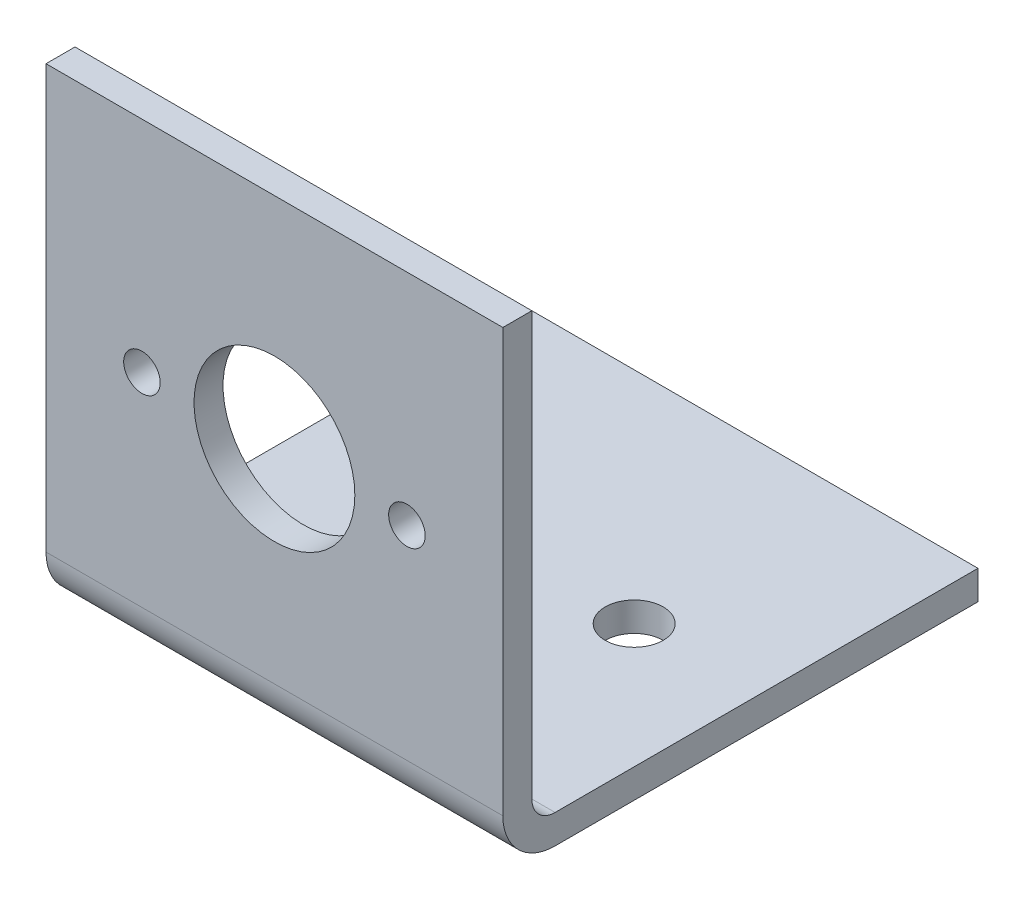
ISO-10303-21;
HEADER;
FILE_DESCRIPTION(('STEP AP214'),'2;1');
FILE_NAME('part.step','',(''),(''),'','','');
FILE_SCHEMA(('AUTOMOTIVE_DESIGN { 1 0 10303 214 1 1 1 1 }'));
ENDSEC;
DATA;
#1=APPLICATION_CONTEXT('core data for automotive mechanical design processes');
#2=APPLICATION_PROTOCOL_DEFINITION('international standard','automotive_design',2000,#1);
#3=PRODUCT_CONTEXT('',#1,'mechanical');
#4=PRODUCT('Part','Part','',(#3));
#5=PRODUCT_RELATED_PRODUCT_CATEGORY('part','',(#4));
#6=PRODUCT_DEFINITION_FORMATION('','',#4);
#7=PRODUCT_DEFINITION_CONTEXT('part definition',#1,'design');
#8=PRODUCT_DEFINITION('design','',#6,#7);
#9=PRODUCT_DEFINITION_SHAPE('','',#8);
#10=(LENGTH_UNIT() NAMED_UNIT(*) SI_UNIT(.MILLI.,.METRE.));
#11=(NAMED_UNIT(*) PLANE_ANGLE_UNIT() SI_UNIT($,.RADIAN.));
#12=(NAMED_UNIT(*) SI_UNIT($,.STERADIAN.) SOLID_ANGLE_UNIT());
#13=UNCERTAINTY_MEASURE_WITH_UNIT(LENGTH_MEASURE(1.E-05),#10,'distance_accuracy_value','');
#14=(GEOMETRIC_REPRESENTATION_CONTEXT(3) GLOBAL_UNCERTAINTY_ASSIGNED_CONTEXT((#13)) GLOBAL_UNIT_ASSIGNED_CONTEXT((#10,
#11,#12)) REPRESENTATION_CONTEXT('',''));
#15=CARTESIAN_POINT('',(0.,0.,0.));
#16=DIRECTION('',(0.,0.,1.));
#17=DIRECTION('',(1.,0.,0.));
#18=AXIS2_PLACEMENT_3D('',#15,#16,#17);
#19=CARTESIAN_POINT('',(50.,0.,-3.175));
#20=DIRECTION('',(0.,-1.,0.));
#21=DIRECTION('',(0.,0.,-1.));
#22=AXIS2_PLACEMENT_3D('',#19,#20,#21);
#23=PLANE('',#22);
#24=DIRECTION('',(0.,0.,1.));
#25=VECTOR('',#24,1.);
#26=CARTESIAN_POINT('',(0.,0.,-3.175));
#27=LINE('',#26,#25);
#28=CARTESIAN_POINT('',(0.,0.,-3.175));
#29=VERTEX_POINT('',#28);
#30=CARTESIAN_POINT('',(0.,0.,0.));
#31=VERTEX_POINT('',#30);
#32=EDGE_CURVE('E117',#29,#31,#27,.T.);
#33=ORIENTED_EDGE('',*,*,#32,.T.);
#34=DIRECTION('',(-1.,0.,0.));
#35=VECTOR('',#34,1.);
#36=CARTESIAN_POINT('',(50.,0.,0.));
#37=LINE('',#36,#35);
#38=CARTESIAN_POINT('',(50.,0.,0.));
#39=VERTEX_POINT('',#38);
#40=EDGE_CURVE('E100',#39,#31,#37,.T.);
#41=ORIENTED_EDGE('',*,*,#40,.F.);
#42=DIRECTION('',(0.,0.,1.));
#43=VECTOR('',#42,1.);
#44=CARTESIAN_POINT('',(50.,0.,-3.175));
#45=LINE('',#44,#43);
#46=CARTESIAN_POINT('',(50.,0.,-3.175));
#47=VERTEX_POINT('',#46);
#48=EDGE_CURVE('E105',#47,#39,#45,.T.);
#49=ORIENTED_EDGE('',*,*,#48,.F.);
#50=DIRECTION('',(-1.,0.,0.));
#51=VECTOR('',#50,1.);
#52=CARTESIAN_POINT('',(50.,0.,-3.175));
#53=LINE('',#52,#51);
#54=EDGE_CURVE('E182',#47,#29,#53,.T.);
#55=ORIENTED_EDGE('',*,*,#54,.T.);
#56=EDGE_LOOP('',(#33,#41,#49,#55));
#57=FACE_BOUND('',#56,.T.);
#58=ADVANCED_FACE('F33',(#57),#23,.F.);
#59=CARTESIAN_POINT('',(50.,0.,0.));
#60=DIRECTION('',(0.,0.,-1.));
#61=DIRECTION('',(0.,1.,0.));
#62=AXIS2_PLACEMENT_3D('',#59,#60,#61);
#63=PLANE('',#62);
#64=CARTESIAN_POINT('',(10.5,-24.,0.));
#65=DIRECTION('',(0.,0.,-1.));
#66=DIRECTION('',(0.,1.,0.));
#67=AXIS2_PLACEMENT_3D('',#64,#65,#66);
#68=CIRCLE('',#67,2.);
#69=CARTESIAN_POINT('',(10.5,-22.,0.));
#70=VERTEX_POINT('',#69);
#71=EDGE_CURVE('E143',#70,#70,#68,.T.);
#72=ORIENTED_EDGE('',*,*,#71,.T.);
#73=EDGE_LOOP('',(#72));
#74=FACE_BOUND('',#73,.T.);
#75=CARTESIAN_POINT('',(39.5,-24.,0.));
#76=DIRECTION('',(0.,0.,-1.));
#77=DIRECTION('',(0.,1.,0.));
#78=AXIS2_PLACEMENT_3D('',#75,#76,#77);
#79=CIRCLE('',#78,2.);
#80=CARTESIAN_POINT('',(39.5,-22.,0.));
#81=VERTEX_POINT('',#80);
#82=EDGE_CURVE('E147',#81,#81,#79,.T.);
#83=ORIENTED_EDGE('',*,*,#82,.T.);
#84=EDGE_LOOP('',(#83));
#85=FACE_BOUND('',#84,.T.);
#86=CARTESIAN_POINT('',(25.,-24.,0.));
#87=DIRECTION('',(0.,0.,-1.));
#88=DIRECTION('',(0.,1.,0.));
#89=AXIS2_PLACEMENT_3D('',#86,#87,#88);
#90=CIRCLE('',#89,8.8);
#91=CARTESIAN_POINT('',(25.,-15.2,0.));
#92=VERTEX_POINT('',#91);
#93=EDGE_CURVE('E142',#92,#92,#90,.T.);
#94=ORIENTED_EDGE('',*,*,#93,.T.);
#95=EDGE_LOOP('',(#94));
#96=FACE_BOUND('',#95,.T.);
#97=DIRECTION('',(0.,-1.,0.));
#98=VECTOR('',#97,1.);
#99=CARTESIAN_POINT('',(0.,0.,0.));
#100=LINE('',#99,#98);
#101=CARTESIAN_POINT('',(0.,-46.285,0.));
#102=VERTEX_POINT('',#101);
#103=EDGE_CURVE('E184',#31,#102,#100,.T.);
#104=ORIENTED_EDGE('',*,*,#103,.T.);
#105=DIRECTION('',(-1.,0.,0.));
#106=VECTOR('',#105,1.);
#107=CARTESIAN_POINT('',(50.,-46.285,0.));
#108=LINE('',#107,#106);
#109=CARTESIAN_POINT('',(50.,-46.285,0.));
#110=VERTEX_POINT('',#109);
#111=EDGE_CURVE('E42',#102,#110,#108,.F.);
#112=ORIENTED_EDGE('',*,*,#111,.T.);
#113=DIRECTION('',(0.,-1.,0.));
#114=VECTOR('',#113,1.);
#115=CARTESIAN_POINT('',(50.,0.,0.));
#116=LINE('',#115,#114);
#117=EDGE_CURVE('E96',#39,#110,#116,.T.);
#118=ORIENTED_EDGE('',*,*,#117,.F.);
#119=ORIENTED_EDGE('',*,*,#40,.T.);
#120=EDGE_LOOP('',(#104,#112,#118,#119));
#121=FACE_BOUND('',#120,.T.);
#122=ADVANCED_FACE('F98',(#74,#85,#96,#121),#63,.F.);
#123=CARTESIAN_POINT('',(50.,-52.,0.));
#124=DIRECTION('',(0.,1.,0.));
#125=DIRECTION('',(0.,0.,1.));
#126=AXIS2_PLACEMENT_3D('',#123,#124,#125);
#127=PLANE('',#126);
#128=CARTESIAN_POINT('',(13.57,-52.,-27.94));
#129=DIRECTION('',(0.,1.,0.));
#130=DIRECTION('',(0.,0.,1.));
#131=AXIS2_PLACEMENT_3D('',#128,#129,#130);
#132=CIRCLE('',#131,3.175);
#133=CARTESIAN_POINT('',(13.57,-52.,-24.765));
#134=VERTEX_POINT('',#133);
#135=EDGE_CURVE('E148',#134,#134,#132,.T.);
#136=ORIENTED_EDGE('',*,*,#135,.T.);
#137=EDGE_LOOP('',(#136));
#138=FACE_BOUND('',#137,.T.);
#139=CARTESIAN_POINT('',(36.43,-52.,-27.94));
#140=DIRECTION('',(0.,1.,0.));
#141=DIRECTION('',(0.,0.,1.));
#142=AXIS2_PLACEMENT_3D('',#139,#140,#141);
#143=CIRCLE('',#142,3.175);
#144=CARTESIAN_POINT('',(36.43,-52.,-24.765));
#145=VERTEX_POINT('',#144);
#146=EDGE_CURVE('E157',#145,#145,#143,.T.);
#147=ORIENTED_EDGE('',*,*,#146,.T.);
#148=EDGE_LOOP('',(#147));
#149=FACE_BOUND('',#148,.T.);
#150=CARTESIAN_POINT('',(25.,-52.,-12.7));
#151=DIRECTION('',(0.,1.,0.));
#152=DIRECTION('',(0.,0.,1.));
#153=AXIS2_PLACEMENT_3D('',#150,#151,#152);
#154=CIRCLE('',#153,3.175);
#155=CARTESIAN_POINT('',(25.,-52.,-9.525));
#156=VERTEX_POINT('',#155);
#157=EDGE_CURVE('E154',#156,#156,#154,.T.);
#158=ORIENTED_EDGE('',*,*,#157,.T.);
#159=EDGE_LOOP('',(#158));
#160=FACE_BOUND('',#159,.T.);
#161=DIRECTION('',(0.,0.,-1.));
#162=VECTOR('',#161,1.);
#163=CARTESIAN_POINT('',(50.,-52.,0.));
#164=LINE('',#163,#162);
#165=CARTESIAN_POINT('',(50.,-52.,-5.715));
#166=VERTEX_POINT('',#165);
#167=CARTESIAN_POINT('',(50.,-52.,-52.));
#168=VERTEX_POINT('',#167);
#169=EDGE_CURVE('E104',#166,#168,#164,.T.);
#170=ORIENTED_EDGE('',*,*,#169,.F.);
#171=DIRECTION('',(-1.,0.,0.));
#172=VECTOR('',#171,1.);
#173=CARTESIAN_POINT('',(50.,-52.,-5.715));
#174=LINE('',#173,#172);
#175=CARTESIAN_POINT('',(0.,-52.,-5.715));
#176=VERTEX_POINT('',#175);
#177=EDGE_CURVE('E134',#166,#176,#174,.T.);
#178=ORIENTED_EDGE('',*,*,#177,.T.);
#179=DIRECTION('',(0.,0.,-1.));
#180=VECTOR('',#179,1.);
#181=CARTESIAN_POINT('',(0.,-52.,0.));
#182=LINE('',#181,#180);
#183=CARTESIAN_POINT('',(0.,-52.,-52.));
#184=VERTEX_POINT('',#183);
#185=EDGE_CURVE('E186',#176,#184,#182,.T.);
#186=ORIENTED_EDGE('',*,*,#185,.T.);
#187=DIRECTION('',(-1.,0.,0.));
#188=VECTOR('',#187,1.);
#189=CARTESIAN_POINT('',(50.,-52.,-52.));
#190=LINE('',#189,#188);
#191=EDGE_CURVE('E119',#168,#184,#190,.T.);
#192=ORIENTED_EDGE('',*,*,#191,.F.);
#193=EDGE_LOOP('',(#170,#178,#186,#192));
#194=FACE_BOUND('',#193,.T.);
#195=ADVANCED_FACE('F217',(#138,#149,#160,#194),#127,.F.);
#196=CARTESIAN_POINT('',(50.,-52.,-52.));
#197=DIRECTION('',(0.,0.,1.));
#198=DIRECTION('',(1.,0.,0.));
#199=AXIS2_PLACEMENT_3D('',#196,#197,#198);
#200=PLANE('',#199);
#201=DIRECTION('',(0.,1.,0.));
#202=VECTOR('',#201,1.);
#203=CARTESIAN_POINT('',(0.,-52.,-52.));
#204=LINE('',#203,#202);
#205=CARTESIAN_POINT('',(0.,-48.825,-52.));
#206=VERTEX_POINT('',#205);
#207=EDGE_CURVE('E188',#184,#206,#204,.T.);
#208=ORIENTED_EDGE('',*,*,#207,.T.);
#209=DIRECTION('',(-1.,0.,0.));
#210=VECTOR('',#209,1.);
#211=CARTESIAN_POINT('',(50.,-48.825,-52.));
#212=LINE('',#211,#210);
#213=CARTESIAN_POINT('',(50.,-48.825,-52.));
#214=VERTEX_POINT('',#213);
#215=EDGE_CURVE('E125',#214,#206,#212,.T.);
#216=ORIENTED_EDGE('',*,*,#215,.F.);
#217=DIRECTION('',(0.,1.,0.));
#218=VECTOR('',#217,1.);
#219=CARTESIAN_POINT('',(50.,-52.,-52.));
#220=LINE('',#219,#218);
#221=EDGE_CURVE('E176',#168,#214,#220,.T.);
#222=ORIENTED_EDGE('',*,*,#221,.F.);
#223=ORIENTED_EDGE('',*,*,#191,.T.);
#224=EDGE_LOOP('',(#208,#216,#222,#223));
#225=FACE_BOUND('',#224,.T.);
#226=ADVANCED_FACE('F218',(#225),#200,.F.);
#227=CARTESIAN_POINT('',(50.,-48.825,-52.));
#228=DIRECTION('',(0.,-1.,0.));
#229=DIRECTION('',(0.,0.,-1.));
#230=AXIS2_PLACEMENT_3D('',#227,#228,#229);
#231=PLANE('',#230);
#232=CARTESIAN_POINT('',(13.57,-48.825,-27.94));
#233=DIRECTION('',(0.,-1.,0.));
#234=DIRECTION('',(0.,0.,-1.));
#235=AXIS2_PLACEMENT_3D('',#232,#233,#234);
#236=CIRCLE('',#235,3.175);
#237=CARTESIAN_POINT('',(13.57,-48.825,-31.115));
#238=VERTEX_POINT('',#237);
#239=EDGE_CURVE('E37',#238,#238,#236,.T.);
#240=ORIENTED_EDGE('',*,*,#239,.T.);
#241=EDGE_LOOP('',(#240));
#242=FACE_BOUND('',#241,.T.);
#243=CARTESIAN_POINT('',(36.43,-48.825,-27.94));
#244=DIRECTION('',(0.,-1.,0.));
#245=DIRECTION('',(0.,0.,-1.));
#246=AXIS2_PLACEMENT_3D('',#243,#244,#245);
#247=CIRCLE('',#246,3.175);
#248=CARTESIAN_POINT('',(36.43,-48.825,-31.115));
#249=VERTEX_POINT('',#248);
#250=EDGE_CURVE('E155',#249,#249,#247,.T.);
#251=ORIENTED_EDGE('',*,*,#250,.T.);
#252=EDGE_LOOP('',(#251));
#253=FACE_BOUND('',#252,.T.);
#254=CARTESIAN_POINT('',(25.,-48.825,-12.7));
#255=DIRECTION('',(0.,-1.,0.));
#256=DIRECTION('',(0.,0.,-1.));
#257=AXIS2_PLACEMENT_3D('',#254,#255,#256);
#258=CIRCLE('',#257,3.175);
#259=CARTESIAN_POINT('',(25.,-48.825,-15.875));
#260=VERTEX_POINT('',#259);
#261=EDGE_CURVE('E152',#260,#260,#258,.T.);
#262=ORIENTED_EDGE('',*,*,#261,.T.);
#263=EDGE_LOOP('',(#262));
#264=FACE_BOUND('',#263,.T.);
#265=DIRECTION('',(0.,0.,1.));
#266=VECTOR('',#265,1.);
#267=CARTESIAN_POINT('',(0.,-48.825,-52.));
#268=LINE('',#267,#266);
#269=CARTESIAN_POINT('',(0.,-48.825,-5.715));
#270=VERTEX_POINT('',#269);
#271=EDGE_CURVE('E190',#206,#270,#268,.T.);
#272=ORIENTED_EDGE('',*,*,#271,.T.);
#273=DIRECTION('',(-1.,0.,0.));
#274=VECTOR('',#273,1.);
#275=CARTESIAN_POINT('',(50.,-48.825,-5.715));
#276=LINE('',#275,#274);
#277=CARTESIAN_POINT('',(50.,-48.825,-5.715));
#278=VERTEX_POINT('',#277);
#279=EDGE_CURVE('E122',#270,#278,#276,.F.);
#280=ORIENTED_EDGE('',*,*,#279,.T.);
#281=DIRECTION('',(0.,0.,1.));
#282=VECTOR('',#281,1.);
#283=CARTESIAN_POINT('',(50.,-48.825,-52.));
#284=LINE('',#283,#282);
#285=EDGE_CURVE('E178',#214,#278,#284,.T.);
#286=ORIENTED_EDGE('',*,*,#285,.F.);
#287=ORIENTED_EDGE('',*,*,#215,.T.);
#288=EDGE_LOOP('',(#272,#280,#286,#287));
#289=FACE_BOUND('',#288,.T.);
#290=ADVANCED_FACE('F199',(#242,#253,#264,#289),#231,.F.);
#291=CARTESIAN_POINT('',(50.,-48.825,-3.175));
#292=DIRECTION('',(0.,0.,1.));
#293=DIRECTION('',(1.,0.,0.));
#294=AXIS2_PLACEMENT_3D('',#291,#292,#293);
#295=PLANE('',#294);
#296=CARTESIAN_POINT('',(10.5,-24.,-3.175));
#297=DIRECTION('',(0.,0.,1.));
#298=DIRECTION('',(1.,0.,0.));
#299=AXIS2_PLACEMENT_3D('',#296,#297,#298);
#300=CIRCLE('',#299,2.);
#301=CARTESIAN_POINT('',(12.5,-24.,-3.175));
#302=VERTEX_POINT('',#301);
#303=EDGE_CURVE('E149',#302,#302,#300,.T.);
#304=ORIENTED_EDGE('',*,*,#303,.T.);
#305=EDGE_LOOP('',(#304));
#306=FACE_BOUND('',#305,.T.);
#307=CARTESIAN_POINT('',(39.5,-24.,-3.175));
#308=DIRECTION('',(0.,0.,1.));
#309=DIRECTION('',(1.,0.,0.));
#310=AXIS2_PLACEMENT_3D('',#307,#308,#309);
#311=CIRCLE('',#310,2.);
#312=CARTESIAN_POINT('',(41.5,-24.,-3.175));
#313=VERTEX_POINT('',#312);
#314=EDGE_CURVE('E144',#313,#313,#311,.T.);
#315=ORIENTED_EDGE('',*,*,#314,.T.);
#316=EDGE_LOOP('',(#315));
#317=FACE_BOUND('',#316,.T.);
#318=CARTESIAN_POINT('',(25.,-24.,-3.175));
#319=DIRECTION('',(0.,0.,1.));
#320=DIRECTION('',(1.,0.,0.));
#321=AXIS2_PLACEMENT_3D('',#318,#319,#320);
#322=CIRCLE('',#321,8.8);
#323=CARTESIAN_POINT('',(33.8,-24.,-3.175));
#324=VERTEX_POINT('',#323);
#325=EDGE_CURVE('E139',#324,#324,#322,.T.);
#326=ORIENTED_EDGE('',*,*,#325,.T.);
#327=EDGE_LOOP('',(#326));
#328=FACE_BOUND('',#327,.T.);
#329=DIRECTION('',(0.,1.,0.));
#330=VECTOR('',#329,1.);
#331=CARTESIAN_POINT('',(50.,-48.825,-3.175));
#332=LINE('',#331,#330);
#333=CARTESIAN_POINT('',(50.,-46.285,-3.175));
#334=VERTEX_POINT('',#333);
#335=EDGE_CURVE('E110',#334,#47,#332,.T.);
#336=ORIENTED_EDGE('',*,*,#335,.F.);
#337=DIRECTION('',(-1.,0.,0.));
#338=VECTOR('',#337,1.);
#339=CARTESIAN_POINT('',(0.,-46.285,-3.175));
#340=LINE('',#339,#338);
#341=CARTESIAN_POINT('',(0.,-46.285,-3.175));
#342=VERTEX_POINT('',#341);
#343=EDGE_CURVE('E118',#334,#342,#340,.T.);
#344=ORIENTED_EDGE('',*,*,#343,.T.);
#345=DIRECTION('',(0.,1.,0.));
#346=VECTOR('',#345,1.);
#347=CARTESIAN_POINT('',(0.,-48.825,-3.175));
#348=LINE('',#347,#346);
#349=EDGE_CURVE('E114',#342,#29,#348,.T.);
#350=ORIENTED_EDGE('',*,*,#349,.T.);
#351=ORIENTED_EDGE('',*,*,#54,.F.);
#352=EDGE_LOOP('',(#336,#344,#350,#351));
#353=FACE_BOUND('',#352,.T.);
#354=ADVANCED_FACE('F211',(#306,#317,#328,#353),#295,.F.);
#355=CARTESIAN_POINT('',(50.,0.,0.));
#356=DIRECTION('',(1.,0.,0.));
#357=DIRECTION('',(0.,0.,-1.));
#358=AXIS2_PLACEMENT_3D('',#355,#356,#357);
#359=PLANE('',#358);
#360=ORIENTED_EDGE('',*,*,#117,.T.);
#361=CARTESIAN_POINT('',(50.,-46.285,-5.715));
#362=DIRECTION('',(1.,0.,0.));
#363=DIRECTION('',(0.,0.,-1.));
#364=AXIS2_PLACEMENT_3D('',#361,#362,#363);
#365=CIRCLE('',#364,5.715);
#366=EDGE_CURVE('E11',#110,#166,#365,.T.);
#367=ORIENTED_EDGE('',*,*,#366,.T.);
#368=ORIENTED_EDGE('',*,*,#169,.T.);
#369=ORIENTED_EDGE('',*,*,#221,.T.);
#370=ORIENTED_EDGE('',*,*,#285,.T.);
#371=CARTESIAN_POINT('',(50.,-46.285,-5.715));
#372=DIRECTION('',(1.,0.,0.));
#373=DIRECTION('',(0.,0.,-1.));
#374=AXIS2_PLACEMENT_3D('',#371,#372,#373);
#375=CIRCLE('',#374,2.54);
#376=EDGE_CURVE('E132',#278,#334,#375,.F.);
#377=ORIENTED_EDGE('',*,*,#376,.T.);
#378=ORIENTED_EDGE('',*,*,#335,.T.);
#379=ORIENTED_EDGE('',*,*,#48,.T.);
#380=EDGE_LOOP('',(#360,#367,#368,#369,#370,#377,#378,#379));
#381=FACE_BOUND('',#380,.T.);
#382=ADVANCED_FACE('F108',(#381),#359,.T.);
#383=CARTESIAN_POINT('',(0.,0.,0.));
#384=DIRECTION('',(1.,0.,0.));
#385=DIRECTION('',(0.,0.,-1.));
#386=AXIS2_PLACEMENT_3D('',#383,#384,#385);
#387=PLANE('',#386);
#388=ORIENTED_EDGE('',*,*,#185,.F.);
#389=CARTESIAN_POINT('',(0.,-46.285,-5.715));
#390=DIRECTION('',(1.,0.,0.));
#391=DIRECTION('',(0.,0.,-1.));
#392=AXIS2_PLACEMENT_3D('',#389,#390,#391);
#393=CIRCLE('',#392,5.715);
#394=EDGE_CURVE('E57',#176,#102,#393,.F.);
#395=ORIENTED_EDGE('',*,*,#394,.T.);
#396=ORIENTED_EDGE('',*,*,#103,.F.);
#397=ORIENTED_EDGE('',*,*,#32,.F.);
#398=ORIENTED_EDGE('',*,*,#349,.F.);
#399=CARTESIAN_POINT('',(0.,-46.285,-5.715));
#400=DIRECTION('',(1.,0.,0.));
#401=DIRECTION('',(0.,0.,-1.));
#402=AXIS2_PLACEMENT_3D('',#399,#400,#401);
#403=CIRCLE('',#402,2.54);
#404=EDGE_CURVE('E130',#342,#270,#403,.T.);
#405=ORIENTED_EDGE('',*,*,#404,.T.);
#406=ORIENTED_EDGE('',*,*,#271,.F.);
#407=ORIENTED_EDGE('',*,*,#207,.F.);
#408=EDGE_LOOP('',(#388,#395,#396,#397,#398,#405,#406,#407));
#409=FACE_BOUND('',#408,.T.);
#410=ADVANCED_FACE('F204',(#409),#387,.F.);
#411=CARTESIAN_POINT('',(50.,-46.285,-5.715));
#412=DIRECTION('',(1.,0.,0.));
#413=DIRECTION('',(0.,0.,-1.));
#414=AXIS2_PLACEMENT_3D('',#411,#412,#413);
#415=CYLINDRICAL_SURFACE('',#414,2.54);
#416=ORIENTED_EDGE('',*,*,#376,.F.);
#417=ORIENTED_EDGE('',*,*,#279,.F.);
#418=ORIENTED_EDGE('',*,*,#404,.F.);
#419=ORIENTED_EDGE('',*,*,#343,.F.);
#420=EDGE_LOOP('',(#416,#417,#418,#419));
#421=FACE_BOUND('',#420,.T.);
#422=ADVANCED_FACE('F209',(#421),#415,.F.);
#423=CARTESIAN_POINT('',(50.,-46.285,-5.715));
#424=DIRECTION('',(-1.,0.,0.));
#425=DIRECTION('',(0.,0.,1.));
#426=AXIS2_PLACEMENT_3D('',#423,#424,#425);
#427=CYLINDRICAL_SURFACE('',#426,5.715);
#428=ORIENTED_EDGE('',*,*,#366,.F.);
#429=ORIENTED_EDGE('',*,*,#111,.F.);
#430=ORIENTED_EDGE('',*,*,#394,.F.);
#431=ORIENTED_EDGE('',*,*,#177,.F.);
#432=EDGE_LOOP('',(#428,#429,#430,#431));
#433=FACE_BOUND('',#432,.T.);
#434=ADVANCED_FACE('F35',(#433),#427,.T.);
#435=CARTESIAN_POINT('',(25.,-24.,-52.));
#436=DIRECTION('',(0.,0.,1.));
#437=DIRECTION('',(1.,0.,0.));
#438=AXIS2_PLACEMENT_3D('',#435,#436,#437);
#439=CYLINDRICAL_SURFACE('',#438,8.8);
#440=ORIENTED_EDGE('',*,*,#325,.F.);
#441=EDGE_LOOP('',(#440));
#442=FACE_BOUND('',#441,.T.);
#443=ORIENTED_EDGE('',*,*,#93,.F.);
#444=EDGE_LOOP('',(#443));
#445=FACE_BOUND('',#444,.T.);
#446=ADVANCED_FACE('F243',(#442,#445),#439,.F.);
#447=CARTESIAN_POINT('',(39.5,-24.,-52.));
#448=DIRECTION('',(0.,0.,1.));
#449=DIRECTION('',(1.,0.,0.));
#450=AXIS2_PLACEMENT_3D('',#447,#448,#449);
#451=CYLINDRICAL_SURFACE('',#450,2.);
#452=ORIENTED_EDGE('',*,*,#314,.F.);
#453=EDGE_LOOP('',(#452));
#454=FACE_BOUND('',#453,.T.);
#455=ORIENTED_EDGE('',*,*,#82,.F.);
#456=EDGE_LOOP('',(#455));
#457=FACE_BOUND('',#456,.T.);
#458=ADVANCED_FACE('F263',(#454,#457),#451,.F.);
#459=CARTESIAN_POINT('',(10.5,-24.,-52.));
#460=DIRECTION('',(0.,0.,1.));
#461=DIRECTION('',(1.,0.,0.));
#462=AXIS2_PLACEMENT_3D('',#459,#460,#461);
#463=CYLINDRICAL_SURFACE('',#462,2.);
#464=ORIENTED_EDGE('',*,*,#303,.F.);
#465=EDGE_LOOP('',(#464));
#466=FACE_BOUND('',#465,.T.);
#467=ORIENTED_EDGE('',*,*,#71,.F.);
#468=EDGE_LOOP('',(#467));
#469=FACE_BOUND('',#468,.T.);
#470=ADVANCED_FACE('F269',(#466,#469),#463,.F.);
#471=CARTESIAN_POINT('',(25.,0.,-12.7));
#472=DIRECTION('',(0.,-1.,0.));
#473=DIRECTION('',(0.,0.,-1.));
#474=AXIS2_PLACEMENT_3D('',#471,#472,#473);
#475=CYLINDRICAL_SURFACE('',#474,3.175);
#476=ORIENTED_EDGE('',*,*,#261,.F.);
#477=EDGE_LOOP('',(#476));
#478=FACE_BOUND('',#477,.T.);
#479=ORIENTED_EDGE('',*,*,#157,.F.);
#480=EDGE_LOOP('',(#479));
#481=FACE_BOUND('',#480,.T.);
#482=ADVANCED_FACE('F275',(#478,#481),#475,.F.);
#483=CARTESIAN_POINT('',(36.43,0.,-27.94));
#484=DIRECTION('',(0.,-1.,0.));
#485=DIRECTION('',(0.,0.,-1.));
#486=AXIS2_PLACEMENT_3D('',#483,#484,#485);
#487=CYLINDRICAL_SURFACE('',#486,3.175);
#488=ORIENTED_EDGE('',*,*,#250,.F.);
#489=EDGE_LOOP('',(#488));
#490=FACE_BOUND('',#489,.T.);
#491=ORIENTED_EDGE('',*,*,#146,.F.);
#492=EDGE_LOOP('',(#491));
#493=FACE_BOUND('',#492,.T.);
#494=ADVANCED_FACE('F279',(#490,#493),#487,.F.);
#495=CARTESIAN_POINT('',(13.57,0.,-27.94));
#496=DIRECTION('',(0.,-1.,0.));
#497=DIRECTION('',(0.,0.,-1.));
#498=AXIS2_PLACEMENT_3D('',#495,#496,#497);
#499=CYLINDRICAL_SURFACE('',#498,3.175);
#500=ORIENTED_EDGE('',*,*,#239,.F.);
#501=EDGE_LOOP('',(#500));
#502=FACE_BOUND('',#501,.T.);
#503=ORIENTED_EDGE('',*,*,#135,.F.);
#504=EDGE_LOOP('',(#503));
#505=FACE_BOUND('',#504,.T.);
#506=ADVANCED_FACE('F283',(#502,#505),#499,.F.);
#507=CLOSED_SHELL('',(#58,#122,#195,#226,#290,#354,#382,#410,#422,#434,#446,#458,#470,#482,#494,#506));
#508=MANIFOLD_SOLID_BREP('B2',#507);
#509=ADVANCED_BREP_SHAPE_REPRESENTATION('',(#18,#508),#14);
#510=SHAPE_DEFINITION_REPRESENTATION(#9,#509);
ENDSEC;
END-ISO-10303-21;
